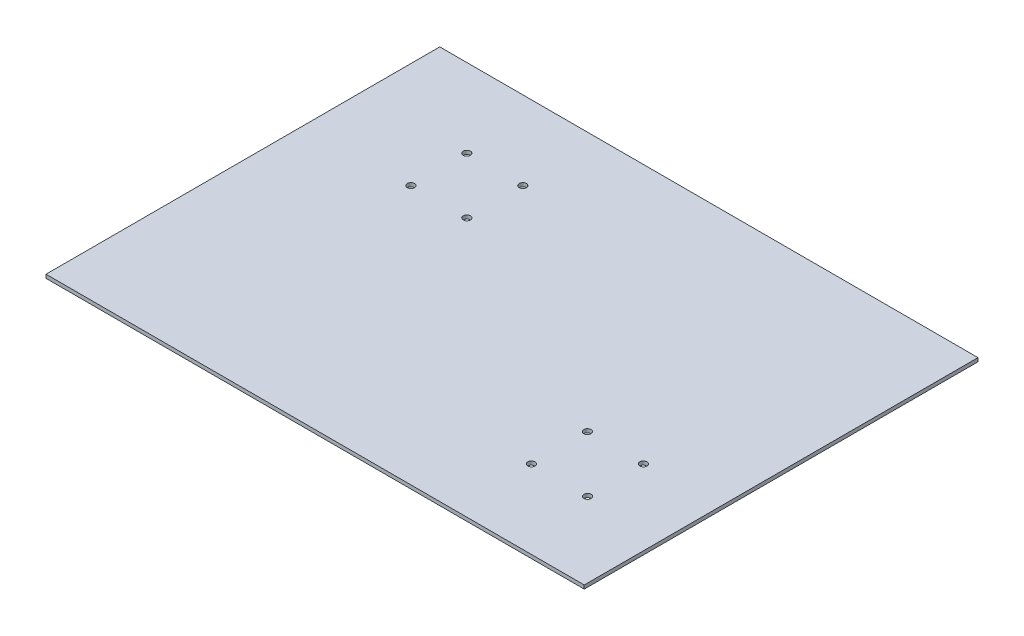
ISO-10303-21;
HEADER;
FILE_DESCRIPTION(('STEP AP214'),'2;1');
FILE_NAME('part.step','',(''),(''),'','','');
FILE_SCHEMA(('AUTOMOTIVE_DESIGN { 1 0 10303 214 1 1 1 1 }'));
ENDSEC;
DATA;
#1=APPLICATION_CONTEXT('core data for automotive mechanical design processes');
#2=APPLICATION_PROTOCOL_DEFINITION('international standard','automotive_design',2000,#1);
#3=PRODUCT_CONTEXT('',#1,'mechanical');
#4=PRODUCT('Part','Part','',(#3));
#5=PRODUCT_RELATED_PRODUCT_CATEGORY('part','',(#4));
#6=PRODUCT_DEFINITION_FORMATION('','',#4);
#7=PRODUCT_DEFINITION_CONTEXT('part definition',#1,'design');
#8=PRODUCT_DEFINITION('design','',#6,#7);
#9=PRODUCT_DEFINITION_SHAPE('','',#8);
#10=(LENGTH_UNIT() NAMED_UNIT(*) SI_UNIT(.MILLI.,.METRE.));
#11=(NAMED_UNIT(*) PLANE_ANGLE_UNIT() SI_UNIT($,.RADIAN.));
#12=(NAMED_UNIT(*) SI_UNIT($,.STERADIAN.) SOLID_ANGLE_UNIT());
#13=UNCERTAINTY_MEASURE_WITH_UNIT(LENGTH_MEASURE(1.E-05),#10,'distance_accuracy_value','');
#14=(GEOMETRIC_REPRESENTATION_CONTEXT(3) GLOBAL_UNCERTAINTY_ASSIGNED_CONTEXT((#13)) GLOBAL_UNIT_ASSIGNED_CONTEXT((#10,
#11,#12)) REPRESENTATION_CONTEXT('',''));
#15=CARTESIAN_POINT('',(0.,0.,0.));
#16=DIRECTION('',(0.,0.,1.));
#17=DIRECTION('',(1.,0.,0.));
#18=AXIS2_PLACEMENT_3D('',#15,#16,#17);
#19=CARTESIAN_POINT('',(298.,0.,-191.321685100182));
#20=DIRECTION('',(0.,0.,1.));
#21=DIRECTION('',(1.,0.,0.));
#22=AXIS2_PLACEMENT_3D('',#19,#20,#21);
#23=PLANE('',#22);
#24=DIRECTION('',(0.,1.,0.));
#25=VECTOR('',#24,1.);
#26=CARTESIAN_POINT('',(0.,0.,-191.321685100182));
#27=LINE('',#26,#25);
#28=CARTESIAN_POINT('',(0.,0.,-191.321685100182));
#29=VERTEX_POINT('',#28);
#30=CARTESIAN_POINT('',(0.,2.,-191.321685100182));
#31=VERTEX_POINT('',#30);
#32=EDGE_CURVE('E115',#29,#31,#27,.T.);
#33=ORIENTED_EDGE('',*,*,#32,.T.);
#34=DIRECTION('',(-1.,0.,0.));
#35=VECTOR('',#34,1.);
#36=CARTESIAN_POINT('',(298.,2.,-191.321685100182));
#37=LINE('',#36,#35);
#38=CARTESIAN_POINT('',(298.,2.,-191.321685100182));
#39=VERTEX_POINT('',#38);
#40=EDGE_CURVE('E11',#39,#31,#37,.T.);
#41=ORIENTED_EDGE('',*,*,#40,.F.);
#42=DIRECTION('',(0.,1.,0.));
#43=VECTOR('',#42,1.);
#44=CARTESIAN_POINT('',(298.,0.,-191.321685100182));
#45=LINE('',#44,#43);
#46=CARTESIAN_POINT('',(298.,0.,-191.321685100182));
#47=VERTEX_POINT('',#46);
#48=EDGE_CURVE('E95',#47,#39,#45,.T.);
#49=ORIENTED_EDGE('',*,*,#48,.F.);
#50=DIRECTION('',(-1.,0.,0.));
#51=VECTOR('',#50,1.);
#52=CARTESIAN_POINT('',(298.,0.,-191.321685100182));
#53=LINE('',#52,#51);
#54=EDGE_CURVE('E111',#47,#29,#53,.T.);
#55=ORIENTED_EDGE('',*,*,#54,.T.);
#56=EDGE_LOOP('',(#33,#41,#49,#55));
#57=FACE_BOUND('',#56,.T.);
#58=ADVANCED_FACE('F45',(#57),#23,.F.);
#59=CARTESIAN_POINT('',(298.,2.,-191.321685100182));
#60=DIRECTION('',(0.,-1.,0.));
#61=DIRECTION('',(0.,0.,-1.));
#62=AXIS2_PLACEMENT_3D('',#59,#60,#61);
#63=PLANE('',#62);
#64=CARTESIAN_POINT('',(58.5,2.,-116.821685100182));
#65=DIRECTION('',(0.,1.,0.));
#66=DIRECTION('',(0.,0.,1.));
#67=AXIS2_PLACEMENT_3D('',#64,#65,#66);
#68=CIRCLE('',#67,2.);
#69=CARTESIAN_POINT('',(58.5,2.,-114.821685100182));
#70=VERTEX_POINT('',#69);
#71=EDGE_CURVE('E354',#70,#70,#68,.T.);
#72=ORIENTED_EDGE('',*,*,#71,.F.);
#73=EDGE_LOOP('',(#72));
#74=FACE_BOUND('',#73,.T.);
#75=CARTESIAN_POINT('',(89.5,2.,-116.821685100182));
#76=DIRECTION('',(0.,1.,0.));
#77=DIRECTION('',(0.,0.,1.));
#78=AXIS2_PLACEMENT_3D('',#75,#76,#77);
#79=CIRCLE('',#78,2.);
#80=CARTESIAN_POINT('',(89.5,2.,-114.821685100182));
#81=VERTEX_POINT('',#80);
#82=EDGE_CURVE('E347',#81,#81,#79,.T.);
#83=ORIENTED_EDGE('',*,*,#82,.F.);
#84=EDGE_LOOP('',(#83));
#85=FACE_BOUND('',#84,.T.);
#86=CARTESIAN_POINT('',(89.5,2.,-147.821685100182));
#87=DIRECTION('',(0.,1.,0.));
#88=DIRECTION('',(0.,0.,-1.));
#89=AXIS2_PLACEMENT_3D('',#86,#87,#88);
#90=CIRCLE('',#89,2.);
#91=CARTESIAN_POINT('',(89.5,2.,-149.821685100182));
#92=VERTEX_POINT('',#91);
#93=EDGE_CURVE('E326',#92,#92,#90,.T.);
#94=ORIENTED_EDGE('',*,*,#93,.F.);
#95=EDGE_LOOP('',(#94));
#96=FACE_BOUND('',#95,.T.);
#97=CARTESIAN_POINT('',(256.457517214141,2.,-16.7194262973637));
#98=DIRECTION('',(0.,1.,0.));
#99=DIRECTION('',(0.,0.,-1.));
#100=AXIS2_PLACEMENT_3D('',#97,#98,#99);
#101=CIRCLE('',#100,2.);
#102=CARTESIAN_POINT('',(256.457517214141,2.,-18.7194262973637));
#103=VERTEX_POINT('',#102);
#104=EDGE_CURVE('E346',#103,#103,#101,.T.);
#105=ORIENTED_EDGE('',*,*,#104,.F.);
#106=EDGE_LOOP('',(#105));
#107=FACE_BOUND('',#106,.T.);
#108=CARTESIAN_POINT('',(225.331301240062,2.,-47.7194262973636));
#109=DIRECTION('',(0.,1.,0.));
#110=DIRECTION('',(0.,0.,1.));
#111=AXIS2_PLACEMENT_3D('',#108,#109,#110);
#112=CIRCLE('',#111,2.);
#113=CARTESIAN_POINT('',(225.331301240062,2.,-45.7194262973636));
#114=VERTEX_POINT('',#113);
#115=EDGE_CURVE('E370',#114,#114,#112,.T.);
#116=ORIENTED_EDGE('',*,*,#115,.F.);
#117=EDGE_LOOP('',(#116));
#118=FACE_BOUND('',#117,.T.);
#119=CARTESIAN_POINT('',(225.331301240062,2.,-16.7194262973638));
#120=DIRECTION('',(0.,1.,0.));
#121=DIRECTION('',(0.,0.,-1.));
#122=AXIS2_PLACEMENT_3D('',#119,#120,#121);
#123=CIRCLE('',#122,2.);
#124=CARTESIAN_POINT('',(225.331301240062,2.,-18.7194262973638));
#125=VERTEX_POINT('',#124);
#126=EDGE_CURVE('E366',#125,#125,#123,.T.);
#127=ORIENTED_EDGE('',*,*,#126,.F.);
#128=EDGE_LOOP('',(#127));
#129=FACE_BOUND('',#128,.T.);
#130=CARTESIAN_POINT('',(58.5,2.,-147.821685100182));
#131=DIRECTION('',(0.,1.,0.));
#132=DIRECTION('',(0.,0.,-1.));
#133=AXIS2_PLACEMENT_3D('',#130,#131,#132);
#134=CIRCLE('',#133,2.);
#135=CARTESIAN_POINT('',(58.5,2.,-149.821685100182));
#136=VERTEX_POINT('',#135);
#137=EDGE_CURVE('E364',#136,#136,#134,.T.);
#138=ORIENTED_EDGE('',*,*,#137,.F.);
#139=EDGE_LOOP('',(#138));
#140=FACE_BOUND('',#139,.T.);
#141=CARTESIAN_POINT('',(256.331301240062,2.,-47.7194262973637));
#142=DIRECTION('',(0.,1.,0.));
#143=DIRECTION('',(0.,0.,1.));
#144=AXIS2_PLACEMENT_3D('',#141,#142,#143);
#145=CIRCLE('',#144,2.);
#146=CARTESIAN_POINT('',(256.331301240062,2.,-45.7194262973637));
#147=VERTEX_POINT('',#146);
#148=EDGE_CURVE('E135',#147,#147,#145,.T.);
#149=ORIENTED_EDGE('',*,*,#148,.F.);
#150=EDGE_LOOP('',(#149));
#151=FACE_BOUND('',#150,.T.);
#152=DIRECTION('',(0.,0.,1.));
#153=VECTOR('',#152,1.);
#154=CARTESIAN_POINT('',(0.,2.,-191.321685100182));
#155=LINE('',#154,#153);
#156=CARTESIAN_POINT('',(0.,2.,26.6783148998178));
#157=VERTEX_POINT('',#156);
#158=EDGE_CURVE('E101',#31,#157,#155,.T.);
#159=ORIENTED_EDGE('',*,*,#158,.T.);
#160=DIRECTION('',(-1.,0.,0.));
#161=VECTOR('',#160,1.);
#162=CARTESIAN_POINT('',(298.,2.,26.6783148998178));
#163=LINE('',#162,#161);
#164=CARTESIAN_POINT('',(298.,2.,26.6783148998178));
#165=VERTEX_POINT('',#164);
#166=EDGE_CURVE('E55',#165,#157,#163,.T.);
#167=ORIENTED_EDGE('',*,*,#166,.F.);
#168=DIRECTION('',(0.,0.,1.));
#169=VECTOR('',#168,1.);
#170=CARTESIAN_POINT('',(298.,2.,-191.321685100182));
#171=LINE('',#170,#169);
#172=EDGE_CURVE('E90',#39,#165,#171,.T.);
#173=ORIENTED_EDGE('',*,*,#172,.F.);
#174=ORIENTED_EDGE('',*,*,#40,.T.);
#175=EDGE_LOOP('',(#159,#167,#173,#174));
#176=FACE_BOUND('',#175,.T.);
#177=ADVANCED_FACE('F100',(#74,#85,#96,#107,#118,#129,#140,#151,#176),#63,.F.);
#178=CARTESIAN_POINT('',(298.,0.,26.6783148998178));
#179=DIRECTION('',(0.,0.,1.));
#180=DIRECTION('',(1.,0.,0.));
#181=AXIS2_PLACEMENT_3D('',#178,#179,#180);
#182=PLANE('',#181);
#183=DIRECTION('',(0.,1.,0.));
#184=VECTOR('',#183,1.);
#185=CARTESIAN_POINT('',(0.,0.,26.6783148998178));
#186=LINE('',#185,#184);
#187=CARTESIAN_POINT('',(0.,0.,26.6783148998178));
#188=VERTEX_POINT('',#187);
#189=EDGE_CURVE('E121',#188,#157,#186,.T.);
#190=ORIENTED_EDGE('',*,*,#189,.F.);
#191=DIRECTION('',(-1.,0.,0.));
#192=VECTOR('',#191,1.);
#193=CARTESIAN_POINT('',(298.,0.,26.6783148998178));
#194=LINE('',#193,#192);
#195=CARTESIAN_POINT('',(298.,0.,26.6783148998178));
#196=VERTEX_POINT('',#195);
#197=EDGE_CURVE('E80',#196,#188,#194,.T.);
#198=ORIENTED_EDGE('',*,*,#197,.F.);
#199=DIRECTION('',(0.,1.,0.));
#200=VECTOR('',#199,1.);
#201=CARTESIAN_POINT('',(298.,0.,26.6783148998178));
#202=LINE('',#201,#200);
#203=EDGE_CURVE('E93',#196,#165,#202,.T.);
#204=ORIENTED_EDGE('',*,*,#203,.T.);
#205=ORIENTED_EDGE('',*,*,#166,.T.);
#206=EDGE_LOOP('',(#190,#198,#204,#205));
#207=FACE_BOUND('',#206,.T.);
#208=ADVANCED_FACE('F107',(#207),#182,.T.);
#209=CARTESIAN_POINT('',(298.,0.,26.6783148998178));
#210=DIRECTION('',(0.,1.,0.));
#211=DIRECTION('',(0.,0.,1.));
#212=AXIS2_PLACEMENT_3D('',#209,#210,#211);
#213=PLANE('',#212);
#214=CARTESIAN_POINT('',(58.5,0.,-116.821685100182));
#215=DIRECTION('',(0.,1.,0.));
#216=DIRECTION('',(0.,0.,1.));
#217=AXIS2_PLACEMENT_3D('',#214,#215,#216);
#218=CIRCLE('',#217,2.);
#219=CARTESIAN_POINT('',(58.5,0.,-114.821685100182));
#220=VERTEX_POINT('',#219);
#221=EDGE_CURVE('E48',#220,#220,#218,.T.);
#222=ORIENTED_EDGE('',*,*,#221,.T.);
#223=EDGE_LOOP('',(#222));
#224=FACE_BOUND('',#223,.T.);
#225=CARTESIAN_POINT('',(89.5,0.,-116.821685100182));
#226=DIRECTION('',(0.,1.,0.));
#227=DIRECTION('',(0.,0.,1.));
#228=AXIS2_PLACEMENT_3D('',#225,#226,#227);
#229=CIRCLE('',#228,2.);
#230=CARTESIAN_POINT('',(89.5,0.,-114.821685100182));
#231=VERTEX_POINT('',#230);
#232=EDGE_CURVE('E154',#231,#231,#229,.T.);
#233=ORIENTED_EDGE('',*,*,#232,.T.);
#234=EDGE_LOOP('',(#233));
#235=FACE_BOUND('',#234,.T.);
#236=CARTESIAN_POINT('',(89.5,0.,-147.821685100182));
#237=DIRECTION('',(0.,1.,0.));
#238=DIRECTION('',(0.,0.,1.));
#239=AXIS2_PLACEMENT_3D('',#236,#237,#238);
#240=CIRCLE('',#239,2.);
#241=CARTESIAN_POINT('',(89.5,0.,-145.821685100182));
#242=VERTEX_POINT('',#241);
#243=EDGE_CURVE('E151',#242,#242,#240,.T.);
#244=ORIENTED_EDGE('',*,*,#243,.T.);
#245=EDGE_LOOP('',(#244));
#246=FACE_BOUND('',#245,.T.);
#247=CARTESIAN_POINT('',(256.457517214141,0.,-16.7194262973637));
#248=DIRECTION('',(0.,1.,0.));
#249=DIRECTION('',(0.,0.,1.));
#250=AXIS2_PLACEMENT_3D('',#247,#248,#249);
#251=CIRCLE('',#250,2.);
#252=CARTESIAN_POINT('',(256.457517214141,0.,-14.7194262973637));
#253=VERTEX_POINT('',#252);
#254=EDGE_CURVE('E147',#253,#253,#251,.T.);
#255=ORIENTED_EDGE('',*,*,#254,.T.);
#256=EDGE_LOOP('',(#255));
#257=FACE_BOUND('',#256,.T.);
#258=CARTESIAN_POINT('',(225.331301240062,0.,-47.7194262973636));
#259=DIRECTION('',(0.,1.,0.));
#260=DIRECTION('',(0.,0.,1.));
#261=AXIS2_PLACEMENT_3D('',#258,#259,#260);
#262=CIRCLE('',#261,2.);
#263=CARTESIAN_POINT('',(225.331301240062,0.,-45.7194262973636));
#264=VERTEX_POINT('',#263);
#265=EDGE_CURVE('E143',#264,#264,#262,.T.);
#266=ORIENTED_EDGE('',*,*,#265,.T.);
#267=EDGE_LOOP('',(#266));
#268=FACE_BOUND('',#267,.T.);
#269=CARTESIAN_POINT('',(225.331301240062,0.,-16.7194262973638));
#270=DIRECTION('',(0.,1.,0.));
#271=DIRECTION('',(0.,0.,1.));
#272=AXIS2_PLACEMENT_3D('',#269,#270,#271);
#273=CIRCLE('',#272,2.);
#274=CARTESIAN_POINT('',(225.331301240062,0.,-14.7194262973638));
#275=VERTEX_POINT('',#274);
#276=EDGE_CURVE('E139',#275,#275,#273,.T.);
#277=ORIENTED_EDGE('',*,*,#276,.T.);
#278=EDGE_LOOP('',(#277));
#279=FACE_BOUND('',#278,.T.);
#280=CARTESIAN_POINT('',(58.5,0.,-147.821685100182));
#281=DIRECTION('',(0.,1.,0.));
#282=DIRECTION('',(0.,0.,1.));
#283=AXIS2_PLACEMENT_3D('',#280,#281,#282);
#284=CIRCLE('',#283,2.);
#285=CARTESIAN_POINT('',(58.5,0.,-145.821685100182));
#286=VERTEX_POINT('',#285);
#287=EDGE_CURVE('E134',#286,#286,#284,.T.);
#288=ORIENTED_EDGE('',*,*,#287,.T.);
#289=EDGE_LOOP('',(#288));
#290=FACE_BOUND('',#289,.T.);
#291=CARTESIAN_POINT('',(256.331301240062,0.,-47.7194262973637));
#292=DIRECTION('',(0.,1.,0.));
#293=DIRECTION('',(0.,0.,1.));
#294=AXIS2_PLACEMENT_3D('',#291,#292,#293);
#295=CIRCLE('',#294,2.);
#296=CARTESIAN_POINT('',(256.331301240062,0.,-45.7194262973637));
#297=VERTEX_POINT('',#296);
#298=EDGE_CURVE('E130',#297,#297,#295,.T.);
#299=ORIENTED_EDGE('',*,*,#298,.T.);
#300=EDGE_LOOP('',(#299));
#301=FACE_BOUND('',#300,.T.);
#302=DIRECTION('',(0.,0.,-1.));
#303=VECTOR('',#302,1.);
#304=CARTESIAN_POINT('',(0.,0.,26.6783148998178));
#305=LINE('',#304,#303);
#306=EDGE_CURVE('E83',#188,#29,#305,.T.);
#307=ORIENTED_EDGE('',*,*,#306,.T.);
#308=ORIENTED_EDGE('',*,*,#54,.F.);
#309=DIRECTION('',(0.,0.,-1.));
#310=VECTOR('',#309,1.);
#311=CARTESIAN_POINT('',(298.,0.,26.6783148998178));
#312=LINE('',#311,#310);
#313=EDGE_CURVE('E64',#196,#47,#312,.T.);
#314=ORIENTED_EDGE('',*,*,#313,.F.);
#315=ORIENTED_EDGE('',*,*,#197,.T.);
#316=EDGE_LOOP('',(#307,#308,#314,#315));
#317=FACE_BOUND('',#316,.T.);
#318=ADVANCED_FACE('F163',(#224,#235,#246,#257,#268,#279,#290,#301,#317),#213,.F.);
#319=CARTESIAN_POINT('',(298.,0.,0.));
#320=DIRECTION('',(1.,0.,0.));
#321=DIRECTION('',(0.,0.,-1.));
#322=AXIS2_PLACEMENT_3D('',#319,#320,#321);
#323=PLANE('',#322);
#324=ORIENTED_EDGE('',*,*,#48,.T.);
#325=ORIENTED_EDGE('',*,*,#172,.T.);
#326=ORIENTED_EDGE('',*,*,#203,.F.);
#327=ORIENTED_EDGE('',*,*,#313,.T.);
#328=EDGE_LOOP('',(#324,#325,#326,#327));
#329=FACE_BOUND('',#328,.T.);
#330=ADVANCED_FACE('F91',(#329),#323,.T.);
#331=CARTESIAN_POINT('',(0.,0.,0.));
#332=DIRECTION('',(1.,0.,0.));
#333=DIRECTION('',(0.,0.,-1.));
#334=AXIS2_PLACEMENT_3D('',#331,#332,#333);
#335=PLANE('',#334);
#336=ORIENTED_EDGE('',*,*,#32,.F.);
#337=ORIENTED_EDGE('',*,*,#306,.F.);
#338=ORIENTED_EDGE('',*,*,#189,.T.);
#339=ORIENTED_EDGE('',*,*,#158,.F.);
#340=EDGE_LOOP('',(#336,#337,#338,#339));
#341=FACE_BOUND('',#340,.T.);
#342=ADVANCED_FACE('F186',(#341),#335,.F.);
#343=CARTESIAN_POINT('',(256.331301240062,-8.,-47.7194262973637));
#344=DIRECTION('',(0.,1.,0.));
#345=DIRECTION('',(0.,0.,1.));
#346=AXIS2_PLACEMENT_3D('',#343,#344,#345);
#347=CYLINDRICAL_SURFACE('',#346,2.);
#348=ORIENTED_EDGE('',*,*,#148,.T.);
#349=EDGE_LOOP('',(#348));
#350=FACE_BOUND('',#349,.T.);
#351=ORIENTED_EDGE('',*,*,#298,.F.);
#352=EDGE_LOOP('',(#351));
#353=FACE_BOUND('',#352,.T.);
#354=ADVANCED_FACE('F188',(#350,#353),#347,.F.);
#355=CARTESIAN_POINT('',(58.5,-8.,-147.821685100182));
#356=DIRECTION('',(0.,1.,0.));
#357=DIRECTION('',(0.,0.,1.));
#358=AXIS2_PLACEMENT_3D('',#355,#356,#357);
#359=CYLINDRICAL_SURFACE('',#358,2.);
#360=ORIENTED_EDGE('',*,*,#137,.T.);
#361=EDGE_LOOP('',(#360));
#362=FACE_BOUND('',#361,.T.);
#363=ORIENTED_EDGE('',*,*,#287,.F.);
#364=EDGE_LOOP('',(#363));
#365=FACE_BOUND('',#364,.T.);
#366=ADVANCED_FACE('F194',(#362,#365),#359,.F.);
#367=CARTESIAN_POINT('',(225.331301240062,-8.,-16.7194262973638));
#368=DIRECTION('',(0.,1.,0.));
#369=DIRECTION('',(0.,0.,1.));
#370=AXIS2_PLACEMENT_3D('',#367,#368,#369);
#371=CYLINDRICAL_SURFACE('',#370,2.);
#372=ORIENTED_EDGE('',*,*,#126,.T.);
#373=EDGE_LOOP('',(#372));
#374=FACE_BOUND('',#373,.T.);
#375=ORIENTED_EDGE('',*,*,#276,.F.);
#376=EDGE_LOOP('',(#375));
#377=FACE_BOUND('',#376,.T.);
#378=ADVANCED_FACE('F255',(#374,#377),#371,.F.);
#379=CARTESIAN_POINT('',(225.331301240062,-8.,-47.7194262973636));
#380=DIRECTION('',(0.,1.,0.));
#381=DIRECTION('',(0.,0.,1.));
#382=AXIS2_PLACEMENT_3D('',#379,#380,#381);
#383=CYLINDRICAL_SURFACE('',#382,2.);
#384=ORIENTED_EDGE('',*,*,#115,.T.);
#385=EDGE_LOOP('',(#384));
#386=FACE_BOUND('',#385,.T.);
#387=ORIENTED_EDGE('',*,*,#265,.F.);
#388=EDGE_LOOP('',(#387));
#389=FACE_BOUND('',#388,.T.);
#390=ADVANCED_FACE('F265',(#386,#389),#383,.F.);
#391=CARTESIAN_POINT('',(256.457517214141,-8.,-16.7194262973637));
#392=DIRECTION('',(0.,1.,0.));
#393=DIRECTION('',(0.,0.,1.));
#394=AXIS2_PLACEMENT_3D('',#391,#392,#393);
#395=CYLINDRICAL_SURFACE('',#394,2.);
#396=ORIENTED_EDGE('',*,*,#104,.T.);
#397=EDGE_LOOP('',(#396));
#398=FACE_BOUND('',#397,.T.);
#399=ORIENTED_EDGE('',*,*,#254,.F.);
#400=EDGE_LOOP('',(#399));
#401=FACE_BOUND('',#400,.T.);
#402=ADVANCED_FACE('F275',(#398,#401),#395,.F.);
#403=CARTESIAN_POINT('',(89.5,-8.,-147.821685100182));
#404=DIRECTION('',(0.,1.,0.));
#405=DIRECTION('',(0.,0.,1.));
#406=AXIS2_PLACEMENT_3D('',#403,#404,#405);
#407=CYLINDRICAL_SURFACE('',#406,2.);
#408=ORIENTED_EDGE('',*,*,#93,.T.);
#409=EDGE_LOOP('',(#408));
#410=FACE_BOUND('',#409,.T.);
#411=ORIENTED_EDGE('',*,*,#243,.F.);
#412=EDGE_LOOP('',(#411));
#413=FACE_BOUND('',#412,.T.);
#414=ADVANCED_FACE('F173',(#410,#413),#407,.F.);
#415=CARTESIAN_POINT('',(89.5,-8.,-116.821685100182));
#416=DIRECTION('',(0.,1.,0.));
#417=DIRECTION('',(0.,0.,1.));
#418=AXIS2_PLACEMENT_3D('',#415,#416,#417);
#419=CYLINDRICAL_SURFACE('',#418,2.);
#420=ORIENTED_EDGE('',*,*,#82,.T.);
#421=EDGE_LOOP('',(#420));
#422=FACE_BOUND('',#421,.T.);
#423=ORIENTED_EDGE('',*,*,#232,.F.);
#424=EDGE_LOOP('',(#423));
#425=FACE_BOUND('',#424,.T.);
#426=ADVANCED_FACE('F167',(#422,#425),#419,.F.);
#427=CARTESIAN_POINT('',(58.5,-8.,-116.821685100182));
#428=DIRECTION('',(0.,1.,0.));
#429=DIRECTION('',(0.,0.,1.));
#430=AXIS2_PLACEMENT_3D('',#427,#428,#429);
#431=CYLINDRICAL_SURFACE('',#430,2.);
#432=ORIENTED_EDGE('',*,*,#71,.T.);
#433=EDGE_LOOP('',(#432));
#434=FACE_BOUND('',#433,.T.);
#435=ORIENTED_EDGE('',*,*,#221,.F.);
#436=EDGE_LOOP('',(#435));
#437=FACE_BOUND('',#436,.T.);
#438=ADVANCED_FACE('F165',(#434,#437),#431,.F.);
#439=CLOSED_SHELL('',(#58,#177,#208,#318,#330,#342,#354,#366,#378,#390,#402,#414,#426,#438));
#440=MANIFOLD_SOLID_BREP('B2',#439);
#441=ADVANCED_BREP_SHAPE_REPRESENTATION('',(#18,#440),#14);
#442=SHAPE_DEFINITION_REPRESENTATION(#9,#441);
ENDSEC;
END-ISO-10303-21;
